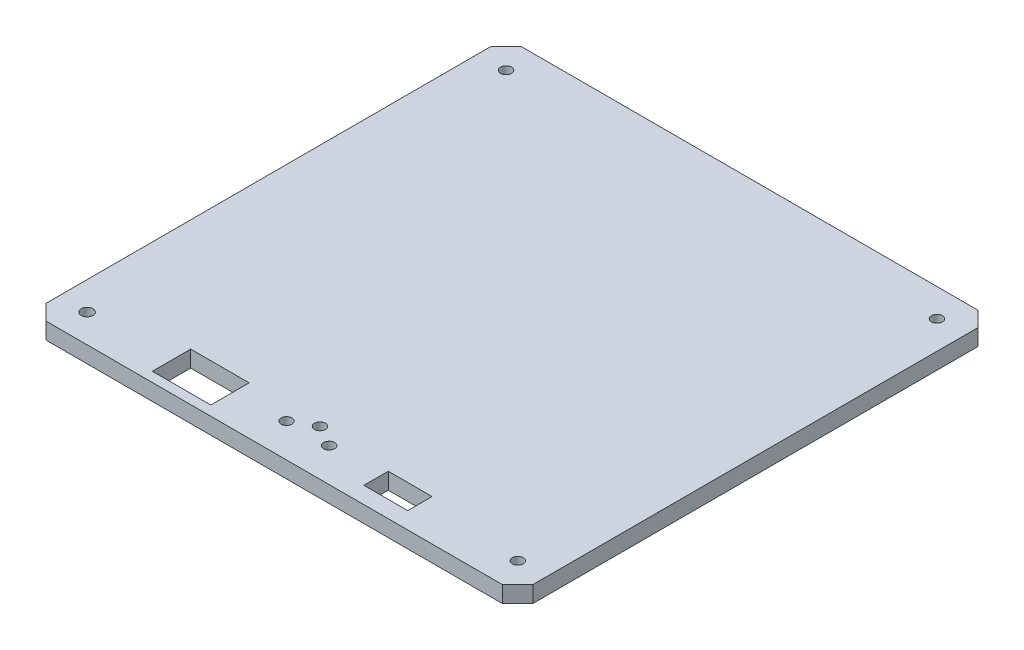
ISO-10303-21;
HEADER;
FILE_DESCRIPTION(('STEP AP214'),'2;1');
FILE_NAME('part.step','',(''),(''),'','','');
FILE_SCHEMA(('AUTOMOTIVE_DESIGN { 1 0 10303 214 1 1 1 1 }'));
ENDSEC;
DATA;
#1=APPLICATION_CONTEXT('core data for automotive mechanical design processes');
#2=APPLICATION_PROTOCOL_DEFINITION('international standard','automotive_design',2000,#1);
#3=PRODUCT_CONTEXT('',#1,'mechanical');
#4=PRODUCT('Part','Part','',(#3));
#5=PRODUCT_RELATED_PRODUCT_CATEGORY('part','',(#4));
#6=PRODUCT_DEFINITION_FORMATION('','',#4);
#7=PRODUCT_DEFINITION_CONTEXT('part definition',#1,'design');
#8=PRODUCT_DEFINITION('design','',#6,#7);
#9=PRODUCT_DEFINITION_SHAPE('','',#8);
#10=(LENGTH_UNIT() NAMED_UNIT(*) SI_UNIT(.MILLI.,.METRE.));
#11=(NAMED_UNIT(*) PLANE_ANGLE_UNIT() SI_UNIT($,.RADIAN.));
#12=(NAMED_UNIT(*) SI_UNIT($,.STERADIAN.) SOLID_ANGLE_UNIT());
#13=UNCERTAINTY_MEASURE_WITH_UNIT(LENGTH_MEASURE(1.E-05),#10,'distance_accuracy_value','');
#14=(GEOMETRIC_REPRESENTATION_CONTEXT(3) GLOBAL_UNCERTAINTY_ASSIGNED_CONTEXT((#13)) GLOBAL_UNIT_ASSIGNED_CONTEXT((#10,
#11,#12)) REPRESENTATION_CONTEXT('',''));
#15=CARTESIAN_POINT('',(0.,0.,0.));
#16=DIRECTION('',(0.,0.,1.));
#17=DIRECTION('',(1.,0.,0.));
#18=AXIS2_PLACEMENT_3D('',#15,#16,#17);
#19=CARTESIAN_POINT('',(101.6,0.,99.187));
#20=DIRECTION('',(1.,0.,0.));
#21=DIRECTION('',(0.,0.,-1.));
#22=AXIS2_PLACEMENT_3D('',#19,#20,#21);
#23=PLANE('',#22);
#24=DIRECTION('',(0.,1.,0.));
#25=VECTOR('',#24,1.);
#26=CARTESIAN_POINT('',(101.6,-9.0930400334557,-92.9281320586188));
#27=LINE('',#26,#25);
#28=CARTESIAN_POINT('',(101.6,0.,-92.9281320586188));
#29=VERTEX_POINT('',#28);
#30=CARTESIAN_POINT('',(101.6,6.858,-92.9281320586188));
#31=VERTEX_POINT('',#30);
#32=EDGE_CURVE('E246',#29,#31,#27,.T.);
#33=ORIENTED_EDGE('',*,*,#32,.T.);
#34=DIRECTION('',(0.,0.,-1.));
#35=VECTOR('',#34,1.);
#36=CARTESIAN_POINT('',(101.6,6.858,99.187));
#37=LINE('',#36,#35);
#38=CARTESIAN_POINT('',(101.6,6.858,92.747495286736));
#39=VERTEX_POINT('',#38);
#40=EDGE_CURVE('E409',#39,#31,#37,.T.);
#41=ORIENTED_EDGE('',*,*,#40,.F.);
#42=DIRECTION('',(0.,1.,0.));
#43=VECTOR('',#42,1.);
#44=CARTESIAN_POINT('',(101.6,-9.0930400334557,92.747495286736));
#45=LINE('',#44,#43);
#46=CARTESIAN_POINT('',(101.6,0.,92.747495286736));
#47=VERTEX_POINT('',#46);
#48=EDGE_CURVE('E280',#47,#39,#45,.T.);
#49=ORIENTED_EDGE('',*,*,#48,.F.);
#50=DIRECTION('',(0.,0.,-1.));
#51=VECTOR('',#50,1.);
#52=CARTESIAN_POINT('',(101.6,0.,99.187));
#53=LINE('',#52,#51);
#54=EDGE_CURVE('E416',#47,#29,#53,.T.);
#55=ORIENTED_EDGE('',*,*,#54,.T.);
#56=EDGE_LOOP('',(#33,#41,#49,#55));
#57=FACE_BOUND('',#56,.T.);
#58=ADVANCED_FACE('F39',(#57),#23,.T.);
#59=CARTESIAN_POINT('',(-101.6,0.,99.187));
#60=DIRECTION('',(0.,0.,1.));
#61=DIRECTION('',(1.,0.,0.));
#62=AXIS2_PLACEMENT_3D('',#59,#60,#61);
#63=PLANE('',#62);
#64=DIRECTION('',(1.,0.,0.));
#65=VECTOR('',#64,1.);
#66=CARTESIAN_POINT('',(-101.6,6.858,99.187));
#67=LINE('',#66,#65);
#68=CARTESIAN_POINT('',(-95.1800189955204,6.858,99.187));
#69=VERTEX_POINT('',#68);
#70=CARTESIAN_POINT('',(95.3411320586188,6.858,99.187));
#71=VERTEX_POINT('',#70);
#72=EDGE_CURVE('E43',#69,#71,#67,.T.);
#73=ORIENTED_EDGE('',*,*,#72,.F.);
#74=DIRECTION('',(0.,1.,0.));
#75=VECTOR('',#74,1.);
#76=CARTESIAN_POINT('',(-95.1800189955204,-9.0930400334557,99.187));
#77=LINE('',#76,#75);
#78=CARTESIAN_POINT('',(-95.1800189955204,0.,99.187));
#79=VERTEX_POINT('',#78);
#80=EDGE_CURVE('E260',#79,#69,#77,.T.);
#81=ORIENTED_EDGE('',*,*,#80,.F.);
#82=DIRECTION('',(1.,0.,0.));
#83=VECTOR('',#82,1.);
#84=CARTESIAN_POINT('',(-101.6,0.,99.187));
#85=LINE('',#84,#83);
#86=CARTESIAN_POINT('',(95.3411320586187,0.,99.187));
#87=VERTEX_POINT('',#86);
#88=EDGE_CURVE('E11',#79,#87,#85,.T.);
#89=ORIENTED_EDGE('',*,*,#88,.T.);
#90=DIRECTION('',(0.,1.,0.));
#91=VECTOR('',#90,1.);
#92=CARTESIAN_POINT('',(95.3411320586188,-9.0930400334557,99.187));
#93=LINE('',#92,#91);
#94=EDGE_CURVE('E277',#87,#71,#93,.T.);
#95=ORIENTED_EDGE('',*,*,#94,.T.);
#96=EDGE_LOOP('',(#73,#81,#89,#95));
#97=FACE_BOUND('',#96,.T.);
#98=ADVANCED_FACE('F446',(#97),#63,.T.);
#99=CARTESIAN_POINT('',(-101.6,0.,99.187));
#100=DIRECTION('',(-1.,0.,0.));
#101=DIRECTION('',(0.,0.,1.));
#102=AXIS2_PLACEMENT_3D('',#99,#100,#101);
#103=PLANE('',#102);
#104=DIRECTION('',(0.,0.,1.));
#105=VECTOR('',#104,1.);
#106=CARTESIAN_POINT('',(-101.6,0.,99.187));
#107=LINE('',#106,#105);
#108=CARTESIAN_POINT('',(-101.6,0.,-93.0071098552417));
#109=VERTEX_POINT('',#108);
#110=CARTESIAN_POINT('',(-101.6,0.,92.747495286736));
#111=VERTEX_POINT('',#110);
#112=EDGE_CURVE('E49',#109,#111,#107,.T.);
#113=ORIENTED_EDGE('',*,*,#112,.T.);
#114=DIRECTION('',(0.,1.,0.));
#115=VECTOR('',#114,1.);
#116=CARTESIAN_POINT('',(-101.6,-9.0930400334557,92.747495286736));
#117=LINE('',#116,#115);
#118=CARTESIAN_POINT('',(-101.6,6.858,92.747495286736));
#119=VERTEX_POINT('',#118);
#120=EDGE_CURVE('E263',#111,#119,#117,.T.);
#121=ORIENTED_EDGE('',*,*,#120,.T.);
#122=DIRECTION('',(0.,0.,1.));
#123=VECTOR('',#122,1.);
#124=CARTESIAN_POINT('',(-101.6,6.858,99.187));
#125=LINE('',#124,#123);
#126=CARTESIAN_POINT('',(-101.6,6.858,-93.0071098552417));
#127=VERTEX_POINT('',#126);
#128=EDGE_CURVE('E433',#127,#119,#125,.T.);
#129=ORIENTED_EDGE('',*,*,#128,.F.);
#130=DIRECTION('',(0.,1.,0.));
#131=VECTOR('',#130,1.);
#132=CARTESIAN_POINT('',(-101.6,-9.0930400334557,-93.0071098552417));
#133=LINE('',#132,#131);
#134=EDGE_CURVE('E237',#109,#127,#133,.T.);
#135=ORIENTED_EDGE('',*,*,#134,.F.);
#136=EDGE_LOOP('',(#113,#121,#129,#135));
#137=FACE_BOUND('',#136,.T.);
#138=ADVANCED_FACE('F467',(#137),#103,.T.);
#139=CARTESIAN_POINT('',(0.,6.858,0.));
#140=DIRECTION('',(0.,-1.,0.));
#141=DIRECTION('',(0.,0.,-1.));
#142=AXIS2_PLACEMENT_3D('',#139,#140,#141);
#143=PLANE('',#142);
#144=CARTESIAN_POINT('',(0.000813672677416055,6.858,80.0466816140601));
#145=DIRECTION('',(0.,1.,0.));
#146=DIRECTION('',(0.,0.,1.));
#147=AXIS2_PLACEMENT_3D('',#144,#145,#146);
#148=CIRCLE('',#147,2.286);
#149=CARTESIAN_POINT('',(0.000813672677416055,6.858,82.3326816140601));
#150=VERTEX_POINT('',#149);
#151=EDGE_CURVE('E499',#150,#150,#148,.T.);
#152=ORIENTED_EDGE('',*,*,#151,.F.);
#153=EDGE_LOOP('',(#152));
#154=FACE_BOUND('',#153,.T.);
#155=CARTESIAN_POINT('',(-89.8618463273226,6.858,-87.4488463273569));
#156=DIRECTION('',(0.,1.,0.));
#157=DIRECTION('',(0.,0.,1.));
#158=AXIS2_PLACEMENT_3D('',#155,#156,#157);
#159=CIRCLE('',#158,2.28599999996569);
#160=CARTESIAN_POINT('',(-89.8618463273226,6.858,-85.1628463273912));
#161=VERTEX_POINT('',#160);
#162=EDGE_CURVE('E276',#161,#161,#159,.T.);
#163=ORIENTED_EDGE('',*,*,#162,.F.);
#164=EDGE_LOOP('',(#163));
#165=FACE_BOUND('',#164,.T.);
#166=CARTESIAN_POINT('',(89.8634736726774,6.858,-87.5399783859399));
#167=DIRECTION('',(0.,1.,0.));
#168=DIRECTION('',(0.,0.,1.));
#169=AXIS2_PLACEMENT_3D('',#166,#167,#168);
#170=CIRCLE('',#169,2.28600000000001);
#171=CARTESIAN_POINT('',(89.8634736726774,6.858,-85.2539783859398));
#172=VERTEX_POINT('',#171);
#173=EDGE_CURVE('E296',#172,#172,#170,.T.);
#174=ORIENTED_EDGE('',*,*,#173,.F.);
#175=EDGE_LOOP('',(#174));
#176=FACE_BOUND('',#175,.T.);
#177=CARTESIAN_POINT('',(89.863473672678,6.858,87.3593416140601));
#178=DIRECTION('',(0.,1.,0.));
#179=DIRECTION('',(0.,0.,1.));
#180=AXIS2_PLACEMENT_3D('',#177,#178,#179);
#181=CIRCLE('',#180,2.28600000000002);
#182=CARTESIAN_POINT('',(89.863473672678,6.858,89.6453416140602));
#183=VERTEX_POINT('',#182);
#184=EDGE_CURVE('E286',#183,#183,#181,.T.);
#185=ORIENTED_EDGE('',*,*,#184,.F.);
#186=EDGE_LOOP('',(#185));
#187=FACE_BOUND('',#186,.T.);
#188=CARTESIAN_POINT('',(-89.8618463273226,6.858,87.3593416140601));
#189=DIRECTION('',(0.,1.,0.));
#190=DIRECTION('',(0.,0.,1.));
#191=AXIS2_PLACEMENT_3D('',#188,#189,#190);
#192=CIRCLE('',#191,2.4503000701882);
#193=CARTESIAN_POINT('',(-89.8618463273226,6.858,89.8096416842483));
#194=VERTEX_POINT('',#193);
#195=EDGE_CURVE('E295',#194,#194,#192,.T.);
#196=ORIENTED_EDGE('',*,*,#195,.F.);
#197=EDGE_LOOP('',(#196));
#198=FACE_BOUND('',#197,.T.);
#199=DIRECTION('',(-1.,0.,0.));
#200=VECTOR('',#199,1.);
#201=CARTESIAN_POINT('',(30.4808136726777,6.858,82.0316076707092));
#202=LINE('',#201,#200);
#203=CARTESIAN_POINT('',(48.7688136726778,6.858,82.0316076707092));
#204=VERTEX_POINT('',#203);
#205=CARTESIAN_POINT('',(30.4808136726777,6.858,82.0316076707092));
#206=VERTEX_POINT('',#205);
#207=EDGE_CURVE('E322',#204,#206,#202,.T.);
#208=ORIENTED_EDGE('',*,*,#207,.F.);
#209=DIRECTION('',(0.,0.,-1.));
#210=VECTOR('',#209,1.);
#211=CARTESIAN_POINT('',(48.7688136726778,6.858,82.0316076707092));
#212=LINE('',#211,#210);
#213=CARTESIAN_POINT('',(48.7688136726777,6.858,92.1916076707092));
#214=VERTEX_POINT('',#213);
#215=EDGE_CURVE('E326',#214,#204,#212,.T.);
#216=ORIENTED_EDGE('',*,*,#215,.F.);
#217=DIRECTION('',(1.,0.,0.));
#218=VECTOR('',#217,1.);
#219=CARTESIAN_POINT('',(30.4808136726777,6.858,92.1916076707092));
#220=LINE('',#219,#218);
#221=CARTESIAN_POINT('',(30.4808136726777,6.858,92.1916076707092));
#222=VERTEX_POINT('',#221);
#223=EDGE_CURVE('E329',#222,#214,#220,.T.);
#224=ORIENTED_EDGE('',*,*,#223,.F.);
#225=DIRECTION('',(0.,0.,1.));
#226=VECTOR('',#225,1.);
#227=CARTESIAN_POINT('',(30.4808136726777,6.858,82.0316076707092));
#228=LINE('',#227,#226);
#229=EDGE_CURVE('E318',#206,#222,#228,.T.);
#230=ORIENTED_EDGE('',*,*,#229,.F.);
#231=EDGE_LOOP('',(#208,#216,#224,#230));
#232=FACE_BOUND('',#231,.T.);
#233=DIRECTION('',(-1.,0.,0.));
#234=VECTOR('',#233,1.);
#235=CARTESIAN_POINT('',(-54.8631863273223,6.858,79.1106076707092));
#236=LINE('',#235,#234);
#237=CARTESIAN_POINT('',(-30.4791863273223,6.858,79.1106076707092));
#238=VERTEX_POINT('',#237);
#239=CARTESIAN_POINT('',(-54.8631863273223,6.858,79.1106076707092));
#240=VERTEX_POINT('',#239);
#241=EDGE_CURVE('E365',#238,#240,#236,.T.);
#242=ORIENTED_EDGE('',*,*,#241,.F.);
#243=DIRECTION('',(0.,0.,-1.));
#244=VECTOR('',#243,1.);
#245=CARTESIAN_POINT('',(-30.4791863273223,6.858,79.1106076707092));
#246=LINE('',#245,#244);
#247=CARTESIAN_POINT('',(-30.4791863273223,6.858,95.1126076707092));
#248=VERTEX_POINT('',#247);
#249=EDGE_CURVE('E369',#248,#238,#246,.T.);
#250=ORIENTED_EDGE('',*,*,#249,.F.);
#251=DIRECTION('',(1.,0.,0.));
#252=VECTOR('',#251,1.);
#253=CARTESIAN_POINT('',(-54.8631863273223,6.858,95.1126076707092));
#254=LINE('',#253,#252);
#255=CARTESIAN_POINT('',(-54.8631863273223,6.858,95.1126076707092));
#256=VERTEX_POINT('',#255);
#257=EDGE_CURVE('E334',#256,#248,#254,.T.);
#258=ORIENTED_EDGE('',*,*,#257,.F.);
#259=DIRECTION('',(0.,0.,1.));
#260=VECTOR('',#259,1.);
#261=CARTESIAN_POINT('',(-54.8631863273223,6.858,79.1106076707092));
#262=LINE('',#261,#260);
#263=EDGE_CURVE('E361',#240,#256,#262,.T.);
#264=ORIENTED_EDGE('',*,*,#263,.F.);
#265=EDGE_LOOP('',(#242,#250,#258,#264));
#266=FACE_BOUND('',#265,.T.);
#267=CARTESIAN_POINT('',(-8.88918632732226,6.858,85.1266816140605));
#268=DIRECTION('',(0.,1.,0.));
#269=DIRECTION('',(0.,0.,1.));
#270=AXIS2_PLACEMENT_3D('',#267,#268,#269);
#271=CIRCLE('',#270,2.28600000000044);
#272=CARTESIAN_POINT('',(-8.88918632732226,6.858,87.4126816140609));
#273=VERTEX_POINT('',#272);
#274=EDGE_CURVE('E400',#273,#273,#271,.T.);
#275=ORIENTED_EDGE('',*,*,#274,.F.);
#276=EDGE_LOOP('',(#275));
#277=FACE_BOUND('',#276,.T.);
#278=CARTESIAN_POINT('',(8.89081367267773,6.858,85.1266816140603));
#279=DIRECTION('',(0.,1.,0.));
#280=DIRECTION('',(0.,0.,1.));
#281=AXIS2_PLACEMENT_3D('',#278,#279,#280);
#282=CIRCLE('',#281,2.28600000000043);
#283=CARTESIAN_POINT('',(8.89081367267773,6.858,87.4126816140607));
#284=VERTEX_POINT('',#283);
#285=EDGE_CURVE('E360',#284,#284,#282,.T.);
#286=ORIENTED_EDGE('',*,*,#285,.F.);
#287=EDGE_LOOP('',(#286));
#288=FACE_BOUND('',#287,.T.);
#289=DIRECTION('',(0.70603241389665,0.,0.708179518573694));
#290=VECTOR('',#289,1.);
#291=CARTESIAN_POINT('',(-101.6,6.858,92.747495286736));
#292=LINE('',#291,#290);
#293=EDGE_CURVE('E227',#119,#69,#292,.T.);
#294=ORIENTED_EDGE('',*,*,#293,.T.);
#295=ORIENTED_EDGE('',*,*,#72,.T.);
#296=DIRECTION('',(0.696977537175228,0.,-0.717092959575782));
#297=VECTOR('',#296,1.);
#298=CARTESIAN_POINT('',(98.5999703913257,6.858,95.8341085506558));
#299=LINE('',#298,#297);
#300=EDGE_CURVE('E272',#71,#39,#299,.T.);
#301=ORIENTED_EDGE('',*,*,#300,.T.);
#302=ORIENTED_EDGE('',*,*,#40,.T.);
#303=DIRECTION('',(0.707106781186548,0.,0.707106781186548));
#304=VECTOR('',#303,1.);
#305=CARTESIAN_POINT('',(95.3411320586188,6.858,-99.187));
#306=LINE('',#305,#304);
#307=CARTESIAN_POINT('',(95.3411320586188,6.858,-99.187));
#308=VERTEX_POINT('',#307);
#309=EDGE_CURVE('E236',#308,#31,#306,.T.);
#310=ORIENTED_EDGE('',*,*,#309,.F.);
#311=DIRECTION('',(-1.,0.,0.));
#312=VECTOR('',#311,1.);
#313=CARTESIAN_POINT('',(-101.6,6.858,-99.187));
#314=LINE('',#313,#312);
#315=CARTESIAN_POINT('',(-95.339504713264,6.858,-99.187));
#316=VERTEX_POINT('',#315);
#317=EDGE_CURVE('E430',#308,#316,#314,.T.);
#318=ORIENTED_EDGE('',*,*,#317,.T.);
#319=DIRECTION('',(0.711673408433172,0.,-0.702510469480072));
#320=VECTOR('',#319,1.);
#321=CARTESIAN_POINT('',(-101.6,6.858,-93.0071098552417));
#322=LINE('',#321,#320);
#323=EDGE_CURVE('E240',#127,#316,#322,.T.);
#324=ORIENTED_EDGE('',*,*,#323,.F.);
#325=ORIENTED_EDGE('',*,*,#128,.T.);
#326=EDGE_LOOP('',(#294,#295,#301,#302,#310,#318,#324,#325));
#327=FACE_BOUND('',#326,.T.);
#328=ADVANCED_FACE('F442',(#154,#165,#176,#187,#198,#232,#266,#277,#288,#327),#143,.F.);
#329=CARTESIAN_POINT('',(0.,0.,0.));
#330=DIRECTION('',(0.,-1.,0.));
#331=DIRECTION('',(0.,0.,-1.));
#332=AXIS2_PLACEMENT_3D('',#329,#330,#331);
#333=PLANE('',#332);
#334=CARTESIAN_POINT('',(0.000813672677416055,0.,80.0466816140601));
#335=DIRECTION('',(0.,-1.,0.));
#336=DIRECTION('',(0.,0.,-1.));
#337=AXIS2_PLACEMENT_3D('',#334,#335,#336);
#338=CIRCLE('',#337,2.286);
#339=CARTESIAN_POINT('',(0.000813672677416055,0.,77.7606816140601));
#340=VERTEX_POINT('',#339);
#341=EDGE_CURVE('E209',#340,#340,#338,.F.);
#342=ORIENTED_EDGE('',*,*,#341,.T.);
#343=EDGE_LOOP('',(#342));
#344=FACE_BOUND('',#343,.T.);
#345=DIRECTION('',(0.,0.,1.));
#346=VECTOR('',#345,1.);
#347=CARTESIAN_POINT('',(75.184,0.,-78.884326737588));
#348=LINE('',#347,#346);
#349=CARTESIAN_POINT('',(75.184,0.,-78.884326737588));
#350=VERTEX_POINT('',#349);
#351=CARTESIAN_POINT('',(75.184,0.,71.483673262412));
#352=VERTEX_POINT('',#351);
#353=EDGE_CURVE('E57',#350,#352,#348,.T.);
#354=ORIENTED_EDGE('',*,*,#353,.F.);
#355=DIRECTION('',(1.,0.,0.));
#356=VECTOR('',#355,1.);
#357=CARTESIAN_POINT('',(-75.184,0.,-78.884326737588));
#358=LINE('',#357,#356);
#359=CARTESIAN_POINT('',(-75.184,0.,-78.884326737588));
#360=VERTEX_POINT('',#359);
#361=EDGE_CURVE('E202',#360,#350,#358,.T.);
#362=ORIENTED_EDGE('',*,*,#361,.F.);
#363=DIRECTION('',(0.,0.,-1.));
#364=VECTOR('',#363,1.);
#365=CARTESIAN_POINT('',(-75.184,0.,-78.884326737588));
#366=LINE('',#365,#364);
#367=CARTESIAN_POINT('',(-75.184,0.,71.483673262412));
#368=VERTEX_POINT('',#367);
#369=EDGE_CURVE('E206',#368,#360,#366,.T.);
#370=ORIENTED_EDGE('',*,*,#369,.F.);
#371=DIRECTION('',(-1.,0.,0.));
#372=VECTOR('',#371,1.);
#373=CARTESIAN_POINT('',(-75.184,0.,71.483673262412));
#374=LINE('',#373,#372);
#375=EDGE_CURVE('E218',#352,#368,#374,.T.);
#376=ORIENTED_EDGE('',*,*,#375,.F.);
#377=EDGE_LOOP('',(#354,#362,#370,#376));
#378=FACE_BOUND('',#377,.T.);
#379=CARTESIAN_POINT('',(-89.8618463273226,0.,-87.4488463273569));
#380=DIRECTION('',(0.,-1.,0.));
#381=DIRECTION('',(0.,0.,-1.));
#382=AXIS2_PLACEMENT_3D('',#379,#380,#381);
#383=CIRCLE('',#382,2.28599999996569);
#384=CARTESIAN_POINT('',(-89.8618463273226,0.,-89.7348463273226));
#385=VERTEX_POINT('',#384);
#386=EDGE_CURVE('E300',#385,#385,#383,.F.);
#387=ORIENTED_EDGE('',*,*,#386,.T.);
#388=EDGE_LOOP('',(#387));
#389=FACE_BOUND('',#388,.T.);
#390=CARTESIAN_POINT('',(89.8634736726774,0.,-87.5399783859399));
#391=DIRECTION('',(0.,-1.,0.));
#392=DIRECTION('',(0.,0.,-1.));
#393=AXIS2_PLACEMENT_3D('',#390,#391,#392);
#394=CIRCLE('',#393,2.28600000000001);
#395=CARTESIAN_POINT('',(89.8634736726774,0.,-89.8259783859399));
#396=VERTEX_POINT('',#395);
#397=EDGE_CURVE('E291',#396,#396,#394,.F.);
#398=ORIENTED_EDGE('',*,*,#397,.T.);
#399=EDGE_LOOP('',(#398));
#400=FACE_BOUND('',#399,.T.);
#401=CARTESIAN_POINT('',(89.863473672678,0.,87.3593416140601));
#402=DIRECTION('',(0.,-1.,0.));
#403=DIRECTION('',(0.,0.,-1.));
#404=AXIS2_PLACEMENT_3D('',#401,#402,#403);
#405=CIRCLE('',#404,2.28600000000002);
#406=CARTESIAN_POINT('',(89.863473672678,0.,85.0733416140601));
#407=VERTEX_POINT('',#406);
#408=EDGE_CURVE('E290',#407,#407,#405,.F.);
#409=ORIENTED_EDGE('',*,*,#408,.T.);
#410=EDGE_LOOP('',(#409));
#411=FACE_BOUND('',#410,.T.);
#412=CARTESIAN_POINT('',(-89.8618463273226,0.,87.3593416140601));
#413=DIRECTION('',(0.,-1.,0.));
#414=DIRECTION('',(0.,0.,-1.));
#415=AXIS2_PLACEMENT_3D('',#412,#413,#414);
#416=CIRCLE('',#415,2.4503000701882);
#417=CARTESIAN_POINT('',(-89.8618463273226,0.,84.9090415438719));
#418=VERTEX_POINT('',#417);
#419=EDGE_CURVE('E313',#418,#418,#416,.F.);
#420=ORIENTED_EDGE('',*,*,#419,.T.);
#421=EDGE_LOOP('',(#420));
#422=FACE_BOUND('',#421,.T.);
#423=DIRECTION('',(0.,0.,1.));
#424=VECTOR('',#423,1.);
#425=CARTESIAN_POINT('',(48.7688136726778,0.,82.0316076707092));
#426=LINE('',#425,#424);
#427=CARTESIAN_POINT('',(48.7688136726778,0.,82.0316076707092));
#428=VERTEX_POINT('',#427);
#429=CARTESIAN_POINT('',(48.7688136726777,0.,92.1916076707092));
#430=VERTEX_POINT('',#429);
#431=EDGE_CURVE('E330',#428,#430,#426,.T.);
#432=ORIENTED_EDGE('',*,*,#431,.F.);
#433=DIRECTION('',(1.,0.,0.));
#434=VECTOR('',#433,1.);
#435=CARTESIAN_POINT('',(30.4808136726777,0.,82.0316076707092));
#436=LINE('',#435,#434);
#437=CARTESIAN_POINT('',(30.4808136726777,0.,82.0316076707092));
#438=VERTEX_POINT('',#437);
#439=EDGE_CURVE('E342',#438,#428,#436,.T.);
#440=ORIENTED_EDGE('',*,*,#439,.F.);
#441=DIRECTION('',(0.,0.,-1.));
#442=VECTOR('',#441,1.);
#443=CARTESIAN_POINT('',(30.4808136726777,0.,82.0316076707092));
#444=LINE('',#443,#442);
#445=CARTESIAN_POINT('',(30.4808136726777,0.,92.1916076707092));
#446=VERTEX_POINT('',#445);
#447=EDGE_CURVE('E338',#446,#438,#444,.T.);
#448=ORIENTED_EDGE('',*,*,#447,.F.);
#449=DIRECTION('',(-1.,0.,0.));
#450=VECTOR('',#449,1.);
#451=CARTESIAN_POINT('',(30.4808136726777,0.,92.1916076707092));
#452=LINE('',#451,#450);
#453=EDGE_CURVE('E333',#430,#446,#452,.T.);
#454=ORIENTED_EDGE('',*,*,#453,.F.);
#455=EDGE_LOOP('',(#432,#440,#448,#454));
#456=FACE_BOUND('',#455,.T.);
#457=DIRECTION('',(0.,0.,1.));
#458=VECTOR('',#457,1.);
#459=CARTESIAN_POINT('',(-30.4791863273223,0.,79.1106076707092));
#460=LINE('',#459,#458);
#461=CARTESIAN_POINT('',(-30.4791863273223,0.,79.1106076707092));
#462=VERTEX_POINT('',#461);
#463=CARTESIAN_POINT('',(-30.4791863273223,0.,95.1126076707092));
#464=VERTEX_POINT('',#463);
#465=EDGE_CURVE('E317',#462,#464,#460,.T.);
#466=ORIENTED_EDGE('',*,*,#465,.F.);
#467=DIRECTION('',(1.,0.,0.));
#468=VECTOR('',#467,1.);
#469=CARTESIAN_POINT('',(-54.8631863273223,0.,79.1106076707092));
#470=LINE('',#469,#468);
#471=CARTESIAN_POINT('',(-54.8631863273223,0.,79.1106076707092));
#472=VERTEX_POINT('',#471);
#473=EDGE_CURVE('E382',#472,#462,#470,.T.);
#474=ORIENTED_EDGE('',*,*,#473,.F.);
#475=DIRECTION('',(0.,0.,-1.));
#476=VECTOR('',#475,1.);
#477=CARTESIAN_POINT('',(-54.8631863273223,0.,79.1106076707092));
#478=LINE('',#477,#476);
#479=CARTESIAN_POINT('',(-54.8631863273223,0.,95.1126076707092));
#480=VERTEX_POINT('',#479);
#481=EDGE_CURVE('E378',#480,#472,#478,.T.);
#482=ORIENTED_EDGE('',*,*,#481,.F.);
#483=DIRECTION('',(-1.,0.,0.));
#484=VECTOR('',#483,1.);
#485=CARTESIAN_POINT('',(-54.8631863273223,0.,95.1126076707092));
#486=LINE('',#485,#484);
#487=EDGE_CURVE('E374',#464,#480,#486,.T.);
#488=ORIENTED_EDGE('',*,*,#487,.F.);
#489=EDGE_LOOP('',(#466,#474,#482,#488));
#490=FACE_BOUND('',#489,.T.);
#491=CARTESIAN_POINT('',(-8.88918632732226,0.,85.1266816140605));
#492=DIRECTION('',(0.,-1.,0.));
#493=DIRECTION('',(0.,0.,-1.));
#494=AXIS2_PLACEMENT_3D('',#491,#492,#493);
#495=CIRCLE('',#494,2.28600000000044);
#496=CARTESIAN_POINT('',(-8.88918632732226,0.,82.84068161406));
#497=VERTEX_POINT('',#496);
#498=EDGE_CURVE('E404',#497,#497,#495,.F.);
#499=ORIENTED_EDGE('',*,*,#498,.T.);
#500=EDGE_LOOP('',(#499));
#501=FACE_BOUND('',#500,.T.);
#502=CARTESIAN_POINT('',(8.89081367267773,0.,85.1266816140603));
#503=DIRECTION('',(0.,-1.,0.));
#504=DIRECTION('',(0.,0.,-1.));
#505=AXIS2_PLACEMENT_3D('',#502,#503,#504);
#506=CIRCLE('',#505,2.28600000000043);
#507=CARTESIAN_POINT('',(8.89081367267773,0.,82.8406816140599));
#508=VERTEX_POINT('',#507);
#509=EDGE_CURVE('E405',#508,#508,#506,.F.);
#510=ORIENTED_EDGE('',*,*,#509,.T.);
#511=EDGE_LOOP('',(#510));
#512=FACE_BOUND('',#511,.T.);
#513=ORIENTED_EDGE('',*,*,#88,.F.);
#514=DIRECTION('',(0.70603241389665,0.,0.708179518573694));
#515=VECTOR('',#514,1.);
#516=CARTESIAN_POINT('',(-101.6,0.,92.747495286736));
#517=LINE('',#516,#515);
#518=EDGE_CURVE('E251',#111,#79,#517,.T.);
#519=ORIENTED_EDGE('',*,*,#518,.F.);
#520=ORIENTED_EDGE('',*,*,#112,.F.);
#521=DIRECTION('',(0.711673408433172,0.,-0.702510469480072));
#522=VECTOR('',#521,1.);
#523=CARTESIAN_POINT('',(-101.6,0.,-93.0071098552417));
#524=LINE('',#523,#522);
#525=CARTESIAN_POINT('',(-95.339504713264,0.,-99.187));
#526=VERTEX_POINT('',#525);
#527=EDGE_CURVE('E235',#109,#526,#524,.T.);
#528=ORIENTED_EDGE('',*,*,#527,.T.);
#529=DIRECTION('',(-1.,0.,0.));
#530=VECTOR('',#529,1.);
#531=CARTESIAN_POINT('',(-101.6,0.,-99.187));
#532=LINE('',#531,#530);
#533=CARTESIAN_POINT('',(95.3411320586188,0.,-99.187));
#534=VERTEX_POINT('',#533);
#535=EDGE_CURVE('E420',#534,#526,#532,.T.);
#536=ORIENTED_EDGE('',*,*,#535,.F.);
#537=DIRECTION('',(0.707106781186548,0.,0.707106781186548));
#538=VECTOR('',#537,1.);
#539=CARTESIAN_POINT('',(95.3411320586188,0.,-99.187));
#540=LINE('',#539,#538);
#541=EDGE_CURVE('E250',#534,#29,#540,.T.);
#542=ORIENTED_EDGE('',*,*,#541,.T.);
#543=ORIENTED_EDGE('',*,*,#54,.F.);
#544=DIRECTION('',(0.696977537175228,0.,-0.717092959575782));
#545=VECTOR('',#544,1.);
#546=CARTESIAN_POINT('',(98.5999703913257,0.,95.8341085506558));
#547=LINE('',#546,#545);
#548=EDGE_CURVE('E245',#87,#47,#547,.T.);
#549=ORIENTED_EDGE('',*,*,#548,.F.);
#550=EDGE_LOOP('',(#513,#519,#520,#528,#536,#542,#543,#549));
#551=FACE_BOUND('',#550,.T.);
#552=ADVANCED_FACE('F41',(#344,#378,#389,#400,#411,#422,#456,#490,#501,#512,#551),#333,.T.);
#553=CARTESIAN_POINT('',(-101.6,0.,-99.187));
#554=DIRECTION('',(0.,0.,-1.));
#555=DIRECTION('',(-1.,0.,0.));
#556=AXIS2_PLACEMENT_3D('',#553,#554,#555);
#557=PLANE('',#556);
#558=DIRECTION('',(0.,1.,0.));
#559=VECTOR('',#558,1.);
#560=CARTESIAN_POINT('',(95.3411320586188,-9.0930400334557,-99.187));
#561=LINE('',#560,#559);
#562=EDGE_CURVE('E252',#534,#308,#561,.T.);
#563=ORIENTED_EDGE('',*,*,#562,.F.);
#564=ORIENTED_EDGE('',*,*,#535,.T.);
#565=DIRECTION('',(0.,1.,0.));
#566=VECTOR('',#565,1.);
#567=CARTESIAN_POINT('',(-95.339504713264,-9.0930400334557,-99.187));
#568=LINE('',#567,#566);
#569=EDGE_CURVE('E65',#526,#316,#568,.T.);
#570=ORIENTED_EDGE('',*,*,#569,.T.);
#571=ORIENTED_EDGE('',*,*,#317,.F.);
#572=EDGE_LOOP('',(#563,#564,#570,#571));
#573=FACE_BOUND('',#572,.T.);
#574=ADVANCED_FACE('F462',(#573),#557,.T.);
#575=CARTESIAN_POINT('',(8.89081367267773,-6.46578440717103,85.1266816140603));
#576=DIRECTION('',(0.,1.,0.));
#577=DIRECTION('',(0.,0.,1.));
#578=AXIS2_PLACEMENT_3D('',#575,#576,#577);
#579=CYLINDRICAL_SURFACE('',#578,2.28600000000043);
#580=ORIENTED_EDGE('',*,*,#285,.T.);
#581=EDGE_LOOP('',(#580));
#582=FACE_BOUND('',#581,.T.);
#583=ORIENTED_EDGE('',*,*,#509,.F.);
#584=EDGE_LOOP('',(#583));
#585=FACE_BOUND('',#584,.T.);
#586=ADVANCED_FACE('F520',(#582,#585),#579,.F.);
#587=CARTESIAN_POINT('',(-8.88918632732226,-6.46578440717103,85.1266816140605));
#588=DIRECTION('',(0.,1.,0.));
#589=DIRECTION('',(0.,0.,1.));
#590=AXIS2_PLACEMENT_3D('',#587,#588,#589);
#591=CYLINDRICAL_SURFACE('',#590,2.28600000000044);
#592=ORIENTED_EDGE('',*,*,#274,.T.);
#593=EDGE_LOOP('',(#592));
#594=FACE_BOUND('',#593,.T.);
#595=ORIENTED_EDGE('',*,*,#498,.F.);
#596=EDGE_LOOP('',(#595));
#597=FACE_BOUND('',#596,.T.);
#598=ADVANCED_FACE('F523',(#594,#597),#591,.F.);
#599=CARTESIAN_POINT('',(-30.4791863273223,36.0237926345231,79.1106076707092));
#600=DIRECTION('',(1.,0.,0.));
#601=DIRECTION('',(0.,0.,-1.));
#602=AXIS2_PLACEMENT_3D('',#599,#600,#601);
#603=PLANE('',#602);
#604=ORIENTED_EDGE('',*,*,#249,.T.);
#605=DIRECTION('',(0.,-1.,0.));
#606=VECTOR('',#605,1.);
#607=CARTESIAN_POINT('',(-30.4791863273223,36.0237926345231,79.1106076707092));
#608=LINE('',#607,#606);
#609=EDGE_CURVE('E366',#238,#462,#608,.T.);
#610=ORIENTED_EDGE('',*,*,#609,.T.);
#611=ORIENTED_EDGE('',*,*,#465,.T.);
#612=DIRECTION('',(0.,-1.,0.));
#613=VECTOR('',#612,1.);
#614=CARTESIAN_POINT('',(-30.4791863273223,36.0237926345231,95.1126076707092));
#615=LINE('',#614,#613);
#616=EDGE_CURVE('E386',#248,#464,#615,.T.);
#617=ORIENTED_EDGE('',*,*,#616,.F.);
#618=EDGE_LOOP('',(#604,#610,#611,#617));
#619=FACE_BOUND('',#618,.T.);
#620=ADVANCED_FACE('F531',(#619),#603,.F.);
#621=CARTESIAN_POINT('',(-54.8631863273223,36.0237926345231,79.1106076707092));
#622=DIRECTION('',(0.,0.,-1.));
#623=DIRECTION('',(-1.,0.,0.));
#624=AXIS2_PLACEMENT_3D('',#621,#622,#623);
#625=PLANE('',#624);
#626=ORIENTED_EDGE('',*,*,#241,.T.);
#627=DIRECTION('',(0.,-1.,0.));
#628=VECTOR('',#627,1.);
#629=CARTESIAN_POINT('',(-54.8631863273223,36.0237926345231,79.1106076707092));
#630=LINE('',#629,#628);
#631=EDGE_CURVE('E389',#240,#472,#630,.T.);
#632=ORIENTED_EDGE('',*,*,#631,.T.);
#633=ORIENTED_EDGE('',*,*,#473,.T.);
#634=ORIENTED_EDGE('',*,*,#609,.F.);
#635=EDGE_LOOP('',(#626,#632,#633,#634));
#636=FACE_BOUND('',#635,.T.);
#637=ADVANCED_FACE('F537',(#636),#625,.F.);
#638=CARTESIAN_POINT('',(-54.8631863273223,36.0237926345231,79.1106076707092));
#639=DIRECTION('',(-1.,0.,0.));
#640=DIRECTION('',(0.,0.,1.));
#641=AXIS2_PLACEMENT_3D('',#638,#639,#640);
#642=PLANE('',#641);
#643=ORIENTED_EDGE('',*,*,#263,.T.);
#644=DIRECTION('',(0.,-1.,0.));
#645=VECTOR('',#644,1.);
#646=CARTESIAN_POINT('',(-54.8631863273223,36.0237926345231,95.1126076707092));
#647=LINE('',#646,#645);
#648=EDGE_CURVE('E392',#256,#480,#647,.T.);
#649=ORIENTED_EDGE('',*,*,#648,.T.);
#650=ORIENTED_EDGE('',*,*,#481,.T.);
#651=ORIENTED_EDGE('',*,*,#631,.F.);
#652=EDGE_LOOP('',(#643,#649,#650,#651));
#653=FACE_BOUND('',#652,.T.);
#654=ADVANCED_FACE('F543',(#653),#642,.F.);
#655=CARTESIAN_POINT('',(-54.8631863273223,36.0237926345231,95.1126076707092));
#656=DIRECTION('',(0.,0.,1.));
#657=DIRECTION('',(1.,0.,0.));
#658=AXIS2_PLACEMENT_3D('',#655,#656,#657);
#659=PLANE('',#658);
#660=ORIENTED_EDGE('',*,*,#257,.T.);
#661=ORIENTED_EDGE('',*,*,#616,.T.);
#662=ORIENTED_EDGE('',*,*,#487,.T.);
#663=ORIENTED_EDGE('',*,*,#648,.F.);
#664=EDGE_LOOP('',(#660,#661,#662,#663));
#665=FACE_BOUND('',#664,.T.);
#666=ADVANCED_FACE('F539',(#665),#659,.F.);
#667=CARTESIAN_POINT('',(48.7688136726778,36.0237926345231,82.0316076707092));
#668=DIRECTION('',(1.,0.,0.));
#669=DIRECTION('',(0.,0.,-1.));
#670=AXIS2_PLACEMENT_3D('',#667,#668,#669);
#671=PLANE('',#670);
#672=ORIENTED_EDGE('',*,*,#215,.T.);
#673=DIRECTION('',(0.,-1.,0.));
#674=VECTOR('',#673,1.);
#675=CARTESIAN_POINT('',(48.7688136726778,36.0237926345231,82.0316076707092));
#676=LINE('',#675,#674);
#677=EDGE_CURVE('E323',#204,#428,#676,.T.);
#678=ORIENTED_EDGE('',*,*,#677,.T.);
#679=ORIENTED_EDGE('',*,*,#431,.T.);
#680=DIRECTION('',(0.,-1.,0.));
#681=VECTOR('',#680,1.);
#682=CARTESIAN_POINT('',(48.7688136726777,36.0237926345231,92.1916076707092));
#683=LINE('',#682,#681);
#684=EDGE_CURVE('E346',#214,#430,#683,.T.);
#685=ORIENTED_EDGE('',*,*,#684,.F.);
#686=EDGE_LOOP('',(#672,#678,#679,#685));
#687=FACE_BOUND('',#686,.T.);
#688=ADVANCED_FACE('F542',(#687),#671,.F.);
#689=CARTESIAN_POINT('',(30.4808136726777,36.0237926345231,82.0316076707092));
#690=DIRECTION('',(0.,0.,-1.));
#691=DIRECTION('',(-1.,0.,0.));
#692=AXIS2_PLACEMENT_3D('',#689,#690,#691);
#693=PLANE('',#692);
#694=ORIENTED_EDGE('',*,*,#207,.T.);
#695=DIRECTION('',(0.,-1.,0.));
#696=VECTOR('',#695,1.);
#697=CARTESIAN_POINT('',(30.4808136726777,36.0237926345231,82.0316076707092));
#698=LINE('',#697,#696);
#699=EDGE_CURVE('E349',#206,#438,#698,.T.);
#700=ORIENTED_EDGE('',*,*,#699,.T.);
#701=ORIENTED_EDGE('',*,*,#439,.T.);
#702=ORIENTED_EDGE('',*,*,#677,.F.);
#703=EDGE_LOOP('',(#694,#700,#701,#702));
#704=FACE_BOUND('',#703,.T.);
#705=ADVANCED_FACE('F553',(#704),#693,.F.);
#706=CARTESIAN_POINT('',(30.4808136726777,36.0237926345231,82.0316076707092));
#707=DIRECTION('',(-1.,0.,0.));
#708=DIRECTION('',(0.,0.,1.));
#709=AXIS2_PLACEMENT_3D('',#706,#707,#708);
#710=PLANE('',#709);
#711=ORIENTED_EDGE('',*,*,#229,.T.);
#712=DIRECTION('',(0.,-1.,0.));
#713=VECTOR('',#712,1.);
#714=CARTESIAN_POINT('',(30.4808136726777,36.0237926345231,92.1916076707092));
#715=LINE('',#714,#713);
#716=EDGE_CURVE('E352',#222,#446,#715,.T.);
#717=ORIENTED_EDGE('',*,*,#716,.T.);
#718=ORIENTED_EDGE('',*,*,#447,.T.);
#719=ORIENTED_EDGE('',*,*,#699,.F.);
#720=EDGE_LOOP('',(#711,#717,#718,#719));
#721=FACE_BOUND('',#720,.T.);
#722=ADVANCED_FACE('F559',(#721),#710,.F.);
#723=CARTESIAN_POINT('',(30.4808136726777,36.0237926345231,92.1916076707092));
#724=DIRECTION('',(0.,0.,1.));
#725=DIRECTION('',(1.,0.,0.));
#726=AXIS2_PLACEMENT_3D('',#723,#724,#725);
#727=PLANE('',#726);
#728=ORIENTED_EDGE('',*,*,#223,.T.);
#729=ORIENTED_EDGE('',*,*,#684,.T.);
#730=ORIENTED_EDGE('',*,*,#453,.T.);
#731=ORIENTED_EDGE('',*,*,#716,.F.);
#732=EDGE_LOOP('',(#728,#729,#730,#731));
#733=FACE_BOUND('',#732,.T.);
#734=ADVANCED_FACE('F555',(#733),#727,.F.);
#735=CARTESIAN_POINT('',(-89.8618463273226,-6.93049518228781,87.3593416140601));
#736=DIRECTION('',(0.,1.,0.));
#737=DIRECTION('',(0.,0.,1.));
#738=AXIS2_PLACEMENT_3D('',#735,#736,#737);
#739=CYLINDRICAL_SURFACE('',#738,2.4503000701882);
#740=ORIENTED_EDGE('',*,*,#195,.T.);
#741=EDGE_LOOP('',(#740));
#742=FACE_BOUND('',#741,.T.);
#743=ORIENTED_EDGE('',*,*,#419,.F.);
#744=EDGE_LOOP('',(#743));
#745=FACE_BOUND('',#744,.T.);
#746=ADVANCED_FACE('F558',(#742,#745),#739,.F.);
#747=CARTESIAN_POINT('',(89.863473672678,-6.93049518228781,87.3593416140601));
#748=DIRECTION('',(0.,1.,0.));
#749=DIRECTION('',(0.,0.,1.));
#750=AXIS2_PLACEMENT_3D('',#747,#748,#749);
#751=CYLINDRICAL_SURFACE('',#750,2.28600000000002);
#752=ORIENTED_EDGE('',*,*,#184,.T.);
#753=EDGE_LOOP('',(#752));
#754=FACE_BOUND('',#753,.T.);
#755=ORIENTED_EDGE('',*,*,#408,.F.);
#756=EDGE_LOOP('',(#755));
#757=FACE_BOUND('',#756,.T.);
#758=ADVANCED_FACE('F569',(#754,#757),#751,.F.);
#759=CARTESIAN_POINT('',(89.8634736726774,-6.93049518228781,-87.5399783859399));
#760=DIRECTION('',(0.,1.,0.));
#761=DIRECTION('',(0.,0.,1.));
#762=AXIS2_PLACEMENT_3D('',#759,#760,#761);
#763=CYLINDRICAL_SURFACE('',#762,2.28600000000001);
#764=ORIENTED_EDGE('',*,*,#173,.T.);
#765=EDGE_LOOP('',(#764));
#766=FACE_BOUND('',#765,.T.);
#767=ORIENTED_EDGE('',*,*,#397,.F.);
#768=EDGE_LOOP('',(#767));
#769=FACE_BOUND('',#768,.T.);
#770=ADVANCED_FACE('F574',(#766,#769),#763,.F.);
#771=CARTESIAN_POINT('',(-89.8618463273226,-6.93049518228781,-87.4488463273569));
#772=DIRECTION('',(0.,1.,0.));
#773=DIRECTION('',(0.,0.,1.));
#774=AXIS2_PLACEMENT_3D('',#771,#772,#773);
#775=CYLINDRICAL_SURFACE('',#774,2.28599999996569);
#776=ORIENTED_EDGE('',*,*,#162,.T.);
#777=EDGE_LOOP('',(#776));
#778=FACE_BOUND('',#777,.T.);
#779=ORIENTED_EDGE('',*,*,#386,.F.);
#780=EDGE_LOOP('',(#779));
#781=FACE_BOUND('',#780,.T.);
#782=ADVANCED_FACE('F571',(#778,#781),#775,.F.);
#783=CARTESIAN_POINT('',(98.5999703913257,-9.0930400334557,95.8341085506558));
#784=DIRECTION('',(0.717092959575782,0.,0.696977537175228));
#785=DIRECTION('',(0.696977537175228,0.,-0.717092959575782));
#786=AXIS2_PLACEMENT_3D('',#783,#784,#785);
#787=PLANE('',#786);
#788=ORIENTED_EDGE('',*,*,#548,.T.);
#789=ORIENTED_EDGE('',*,*,#48,.T.);
#790=ORIENTED_EDGE('',*,*,#300,.F.);
#791=ORIENTED_EDGE('',*,*,#94,.F.);
#792=EDGE_LOOP('',(#788,#789,#790,#791));
#793=FACE_BOUND('',#792,.T.);
#794=ADVANCED_FACE('F450',(#793),#787,.T.);
#795=CARTESIAN_POINT('',(-101.6,-9.0930400334557,-93.0071098552417));
#796=DIRECTION('',(0.702510469480072,0.,0.711673408433172));
#797=DIRECTION('',(0.711673408433172,0.,-0.702510469480072));
#798=AXIS2_PLACEMENT_3D('',#795,#796,#797);
#799=PLANE('',#798);
#800=ORIENTED_EDGE('',*,*,#134,.T.);
#801=ORIENTED_EDGE('',*,*,#323,.T.);
#802=ORIENTED_EDGE('',*,*,#569,.F.);
#803=ORIENTED_EDGE('',*,*,#527,.F.);
#804=EDGE_LOOP('',(#800,#801,#802,#803));
#805=FACE_BOUND('',#804,.T.);
#806=ADVANCED_FACE('F465',(#805),#799,.F.);
#807=CARTESIAN_POINT('',(95.3411320586188,-9.0930400334557,-99.187));
#808=DIRECTION('',(-0.707106781186548,0.,0.707106781186548));
#809=DIRECTION('',(0.707106781186548,0.,0.707106781186548));
#810=AXIS2_PLACEMENT_3D('',#807,#808,#809);
#811=PLANE('',#810);
#812=ORIENTED_EDGE('',*,*,#562,.T.);
#813=ORIENTED_EDGE('',*,*,#309,.T.);
#814=ORIENTED_EDGE('',*,*,#32,.F.);
#815=ORIENTED_EDGE('',*,*,#541,.F.);
#816=EDGE_LOOP('',(#812,#813,#814,#815));
#817=FACE_BOUND('',#816,.T.);
#818=ADVANCED_FACE('F471',(#817),#811,.F.);
#819=CARTESIAN_POINT('',(-101.6,-9.0930400334557,92.747495286736));
#820=DIRECTION('',(-0.708179518573694,0.,0.70603241389665));
#821=DIRECTION('',(0.70603241389665,0.,0.708179518573694));
#822=AXIS2_PLACEMENT_3D('',#819,#820,#821);
#823=PLANE('',#822);
#824=ORIENTED_EDGE('',*,*,#518,.T.);
#825=ORIENTED_EDGE('',*,*,#80,.T.);
#826=ORIENTED_EDGE('',*,*,#293,.F.);
#827=ORIENTED_EDGE('',*,*,#120,.F.);
#828=EDGE_LOOP('',(#824,#825,#826,#827));
#829=FACE_BOUND('',#828,.T.);
#830=ADVANCED_FACE('F469',(#829),#823,.T.);
#831=CARTESIAN_POINT('',(75.184,5.08,-78.884326737588));
#832=DIRECTION('',(1.,0.,0.));
#833=DIRECTION('',(0.,0.,-1.));
#834=AXIS2_PLACEMENT_3D('',#831,#832,#833);
#835=PLANE('',#834);
#836=ORIENTED_EDGE('',*,*,#353,.T.);
#837=DIRECTION('',(0.,-1.,0.));
#838=VECTOR('',#837,1.);
#839=CARTESIAN_POINT('',(75.184,5.08,71.483673262412));
#840=LINE('',#839,#838);
#841=CARTESIAN_POINT('',(75.184,5.08,71.483673262412));
#842=VERTEX_POINT('',#841);
#843=EDGE_CURVE('E177',#842,#352,#840,.T.);
#844=ORIENTED_EDGE('',*,*,#843,.F.);
#845=DIRECTION('',(0.,0.,1.));
#846=VECTOR('',#845,1.);
#847=CARTESIAN_POINT('',(75.184,5.08,-78.884326737588));
#848=LINE('',#847,#846);
#849=CARTESIAN_POINT('',(75.184,5.08,-78.884326737588));
#850=VERTEX_POINT('',#849);
#851=EDGE_CURVE('E181',#850,#842,#848,.T.);
#852=ORIENTED_EDGE('',*,*,#851,.F.);
#853=DIRECTION('',(0.,-1.,0.));
#854=VECTOR('',#853,1.);
#855=CARTESIAN_POINT('',(75.184,5.08,-78.884326737588));
#856=LINE('',#855,#854);
#857=EDGE_CURVE('E224',#850,#350,#856,.T.);
#858=ORIENTED_EDGE('',*,*,#857,.T.);
#859=EDGE_LOOP('',(#836,#844,#852,#858));
#860=FACE_BOUND('',#859,.T.);
#861=ADVANCED_FACE('F179',(#860),#835,.F.);
#862=CARTESIAN_POINT('',(-75.184,5.08,-78.884326737588));
#863=DIRECTION('',(0.,0.,-1.));
#864=DIRECTION('',(-1.,0.,0.));
#865=AXIS2_PLACEMENT_3D('',#862,#863,#864);
#866=PLANE('',#865);
#867=ORIENTED_EDGE('',*,*,#361,.T.);
#868=ORIENTED_EDGE('',*,*,#857,.F.);
#869=DIRECTION('',(1.,0.,0.));
#870=VECTOR('',#869,1.);
#871=CARTESIAN_POINT('',(-75.184,5.08,-78.884326737588));
#872=LINE('',#871,#870);
#873=CARTESIAN_POINT('',(-75.184,5.08,-78.884326737588));
#874=VERTEX_POINT('',#873);
#875=EDGE_CURVE('E188',#874,#850,#872,.T.);
#876=ORIENTED_EDGE('',*,*,#875,.F.);
#877=DIRECTION('',(0.,-1.,0.));
#878=VECTOR('',#877,1.);
#879=CARTESIAN_POINT('',(-75.184,5.08,-78.884326737588));
#880=LINE('',#879,#878);
#881=EDGE_CURVE('E228',#874,#360,#880,.T.);
#882=ORIENTED_EDGE('',*,*,#881,.T.);
#883=EDGE_LOOP('',(#867,#868,#876,#882));
#884=FACE_BOUND('',#883,.T.);
#885=ADVANCED_FACE('F477',(#884),#866,.F.);
#886=CARTESIAN_POINT('',(-75.184,5.08,-78.884326737588));
#887=DIRECTION('',(-1.,0.,0.));
#888=DIRECTION('',(0.,0.,1.));
#889=AXIS2_PLACEMENT_3D('',#886,#887,#888);
#890=PLANE('',#889);
#891=ORIENTED_EDGE('',*,*,#369,.T.);
#892=ORIENTED_EDGE('',*,*,#881,.F.);
#893=DIRECTION('',(0.,0.,-1.));
#894=VECTOR('',#893,1.);
#895=CARTESIAN_POINT('',(-75.184,5.08,-78.884326737588));
#896=LINE('',#895,#894);
#897=CARTESIAN_POINT('',(-75.184,5.08,71.483673262412));
#898=VERTEX_POINT('',#897);
#899=EDGE_CURVE('E197',#898,#874,#896,.T.);
#900=ORIENTED_EDGE('',*,*,#899,.F.);
#901=DIRECTION('',(0.,-1.,0.));
#902=VECTOR('',#901,1.);
#903=CARTESIAN_POINT('',(-75.184,5.08,71.483673262412));
#904=LINE('',#903,#902);
#905=EDGE_CURVE('E187',#898,#368,#904,.T.);
#906=ORIENTED_EDGE('',*,*,#905,.T.);
#907=EDGE_LOOP('',(#891,#892,#900,#906));
#908=FACE_BOUND('',#907,.T.);
#909=ADVANCED_FACE('F591',(#908),#890,.F.);
#910=CARTESIAN_POINT('',(-75.184,5.08,71.483673262412));
#911=DIRECTION('',(0.,0.,1.));
#912=DIRECTION('',(1.,0.,0.));
#913=AXIS2_PLACEMENT_3D('',#910,#911,#912);
#914=PLANE('',#913);
#915=ORIENTED_EDGE('',*,*,#375,.T.);
#916=ORIENTED_EDGE('',*,*,#905,.F.);
#917=DIRECTION('',(-1.,0.,0.));
#918=VECTOR('',#917,1.);
#919=CARTESIAN_POINT('',(-75.184,5.08,71.483673262412));
#920=LINE('',#919,#918);
#921=EDGE_CURVE('E191',#842,#898,#920,.T.);
#922=ORIENTED_EDGE('',*,*,#921,.F.);
#923=ORIENTED_EDGE('',*,*,#843,.T.);
#924=EDGE_LOOP('',(#915,#916,#922,#923));
#925=FACE_BOUND('',#924,.T.);
#926=ADVANCED_FACE('F192',(#925),#914,.F.);
#927=CARTESIAN_POINT('',(0.,5.08,0.));
#928=DIRECTION('',(0.,1.,0.));
#929=DIRECTION('',(0.,0.,1.));
#930=AXIS2_PLACEMENT_3D('',#927,#928,#929);
#931=PLANE('',#930);
#932=ORIENTED_EDGE('',*,*,#851,.T.);
#933=ORIENTED_EDGE('',*,*,#921,.T.);
#934=ORIENTED_EDGE('',*,*,#899,.T.);
#935=ORIENTED_EDGE('',*,*,#875,.T.);
#936=EDGE_LOOP('',(#932,#933,#934,#935));
#937=FACE_BOUND('',#936,.T.);
#938=ADVANCED_FACE('F199',(#937),#931,.F.);
#939=CARTESIAN_POINT('',(0.000813672677416055,-6.46578440716979,80.0466816140601));
#940=DIRECTION('',(0.,1.,0.));
#941=DIRECTION('',(0.,0.,1.));
#942=AXIS2_PLACEMENT_3D('',#939,#940,#941);
#943=CYLINDRICAL_SURFACE('',#942,2.286);
#944=ORIENTED_EDGE('',*,*,#151,.T.);
#945=EDGE_LOOP('',(#944));
#946=FACE_BOUND('',#945,.T.);
#947=ORIENTED_EDGE('',*,*,#341,.F.);
#948=EDGE_LOOP('',(#947));
#949=FACE_BOUND('',#948,.T.);
#950=ADVANCED_FACE('F600',(#946,#949),#943,.F.);
#951=CLOSED_SHELL('',(#58,#98,#138,#328,#552,#574,#586,#598,#620,#637,#654,#666,#688,#705,#722,
#734,#746,#758,#770,#782,#794,#806,#818,#830,#861,#885,#909,#926,#938,#950));
#952=MANIFOLD_SOLID_BREP('B2',#951);
#953=ADVANCED_BREP_SHAPE_REPRESENTATION('',(#18,#952),#14);
#954=SHAPE_DEFINITION_REPRESENTATION(#9,#953);
ENDSEC;
END-ISO-10303-21;
